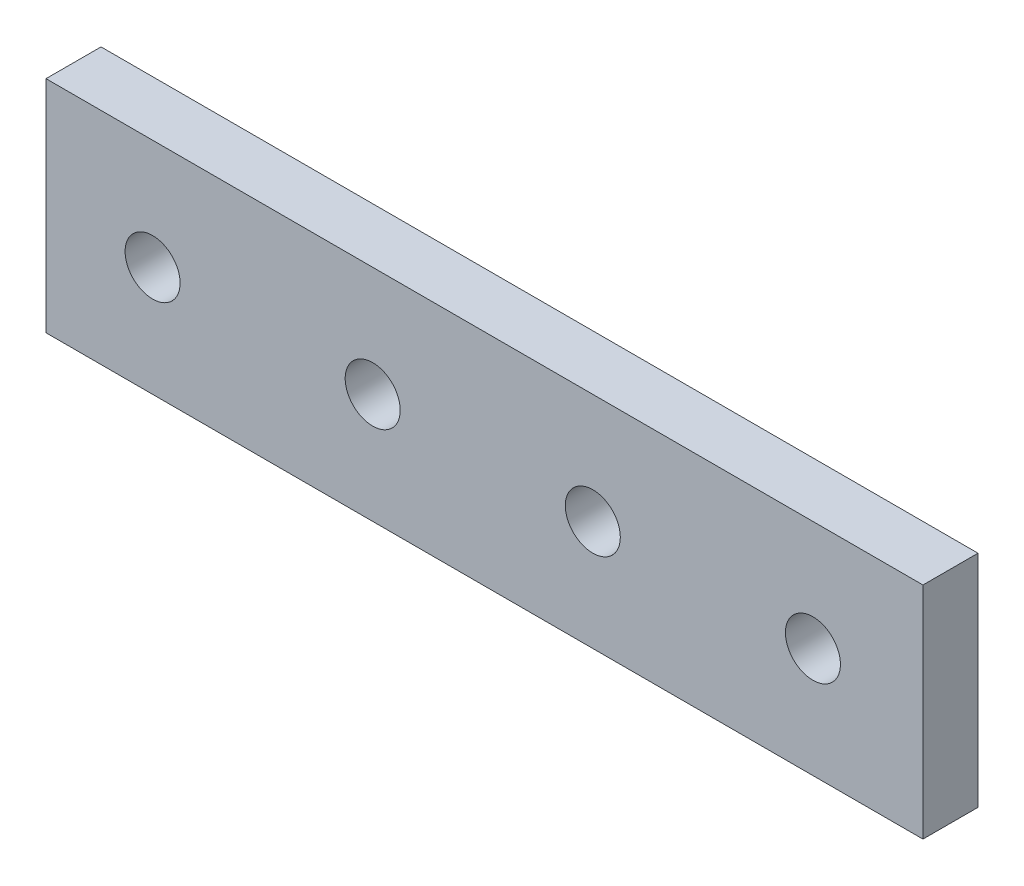
ISO-10303-21;
HEADER;
FILE_DESCRIPTION(('STEP AP214'),'2;1');
FILE_NAME('part.step','',(''),(''),'','','');
FILE_SCHEMA(('AUTOMOTIVE_DESIGN { 1 0 10303 214 1 1 1 1 }'));
ENDSEC;
DATA;
#1=APPLICATION_CONTEXT('core data for automotive mechanical design processes');
#2=APPLICATION_PROTOCOL_DEFINITION('international standard','automotive_design',2000,#1);
#3=PRODUCT_CONTEXT('',#1,'mechanical');
#4=PRODUCT('Part','Part','',(#3));
#5=PRODUCT_RELATED_PRODUCT_CATEGORY('part','',(#4));
#6=PRODUCT_DEFINITION_FORMATION('','',#4);
#7=PRODUCT_DEFINITION_CONTEXT('part definition',#1,'design');
#8=PRODUCT_DEFINITION('design','',#6,#7);
#9=PRODUCT_DEFINITION_SHAPE('','',#8);
#10=(LENGTH_UNIT() NAMED_UNIT(*) SI_UNIT(.MILLI.,.METRE.));
#11=(NAMED_UNIT(*) PLANE_ANGLE_UNIT() SI_UNIT($,.RADIAN.));
#12=(NAMED_UNIT(*) SI_UNIT($,.STERADIAN.) SOLID_ANGLE_UNIT());
#13=UNCERTAINTY_MEASURE_WITH_UNIT(LENGTH_MEASURE(1.E-05),#10,'distance_accuracy_value','');
#14=(GEOMETRIC_REPRESENTATION_CONTEXT(3) GLOBAL_UNCERTAINTY_ASSIGNED_CONTEXT((#13)) GLOBAL_UNIT_ASSIGNED_CONTEXT((#10,
#11,#12)) REPRESENTATION_CONTEXT('',''));
#15=CARTESIAN_POINT('',(0.,0.,0.));
#16=DIRECTION('',(0.,0.,1.));
#17=DIRECTION('',(1.,0.,0.));
#18=AXIS2_PLACEMENT_3D('',#15,#16,#17);
#19=CARTESIAN_POINT('',(50.6,-12.7,6.35));
#20=DIRECTION('',(-1.,0.,0.));
#21=DIRECTION('',(0.,0.,1.));
#22=AXIS2_PLACEMENT_3D('',#19,#20,#21);
#23=PLANE('',#22);
#24=DIRECTION('',(0.,1.,0.));
#25=VECTOR('',#24,1.);
#26=CARTESIAN_POINT('',(50.6,-12.7,0.));
#27=LINE('',#26,#25);
#28=CARTESIAN_POINT('',(50.6,-12.7,0.));
#29=VERTEX_POINT('',#28);
#30=CARTESIAN_POINT('',(50.6,12.7,0.));
#31=VERTEX_POINT('',#30);
#32=EDGE_CURVE('E107',#29,#31,#27,.T.);
#33=ORIENTED_EDGE('',*,*,#32,.T.);
#34=DIRECTION('',(0.,0.,-1.));
#35=VECTOR('',#34,1.);
#36=CARTESIAN_POINT('',(50.6,12.7,6.35));
#37=LINE('',#36,#35);
#38=CARTESIAN_POINT('',(50.6,12.7,6.35));
#39=VERTEX_POINT('',#38);
#40=EDGE_CURVE('E11',#39,#31,#37,.T.);
#41=ORIENTED_EDGE('',*,*,#40,.F.);
#42=DIRECTION('',(0.,1.,0.));
#43=VECTOR('',#42,1.);
#44=CARTESIAN_POINT('',(50.6,-12.7,6.35));
#45=LINE('',#44,#43);
#46=CARTESIAN_POINT('',(50.6,-12.7,6.35));
#47=VERTEX_POINT('',#46);
#48=EDGE_CURVE('E91',#47,#39,#45,.T.);
#49=ORIENTED_EDGE('',*,*,#48,.F.);
#50=DIRECTION('',(0.,0.,-1.));
#51=VECTOR('',#50,1.);
#52=CARTESIAN_POINT('',(50.6,-12.7,6.35));
#53=LINE('',#52,#51);
#54=EDGE_CURVE('E103',#47,#29,#53,.T.);
#55=ORIENTED_EDGE('',*,*,#54,.T.);
#56=EDGE_LOOP('',(#33,#41,#49,#55));
#57=FACE_BOUND('',#56,.T.);
#58=ADVANCED_FACE('F39',(#57),#23,.F.);
#59=CARTESIAN_POINT('',(-50.6,12.7,6.35));
#60=DIRECTION('',(0.,-1.,0.));
#61=DIRECTION('',(0.,0.,-1.));
#62=AXIS2_PLACEMENT_3D('',#59,#60,#61);
#63=PLANE('',#62);
#64=DIRECTION('',(-1.,0.,0.));
#65=VECTOR('',#64,1.);
#66=CARTESIAN_POINT('',(-50.6,12.7,0.));
#67=LINE('',#66,#65);
#68=CARTESIAN_POINT('',(-50.6,12.7,0.));
#69=VERTEX_POINT('',#68);
#70=EDGE_CURVE('E96',#31,#69,#67,.T.);
#71=ORIENTED_EDGE('',*,*,#70,.T.);
#72=DIRECTION('',(0.,0.,-1.));
#73=VECTOR('',#72,1.);
#74=CARTESIAN_POINT('',(-50.6,12.7,6.35));
#75=LINE('',#74,#73);
#76=CARTESIAN_POINT('',(-50.6,12.7,6.35));
#77=VERTEX_POINT('',#76);
#78=EDGE_CURVE('E48',#77,#69,#75,.T.);
#79=ORIENTED_EDGE('',*,*,#78,.F.);
#80=DIRECTION('',(-1.,0.,0.));
#81=VECTOR('',#80,1.);
#82=CARTESIAN_POINT('',(-50.6,12.7,6.35));
#83=LINE('',#82,#81);
#84=EDGE_CURVE('E86',#39,#77,#83,.T.);
#85=ORIENTED_EDGE('',*,*,#84,.F.);
#86=ORIENTED_EDGE('',*,*,#40,.T.);
#87=EDGE_LOOP('',(#71,#79,#85,#86));
#88=FACE_BOUND('',#87,.T.);
#89=ADVANCED_FACE('F95',(#88),#63,.F.);
#90=CARTESIAN_POINT('',(-50.6,-12.7,6.35));
#91=DIRECTION('',(1.,0.,0.));
#92=DIRECTION('',(0.,0.,-1.));
#93=AXIS2_PLACEMENT_3D('',#90,#91,#92);
#94=PLANE('',#93);
#95=DIRECTION('',(0.,-1.,0.));
#96=VECTOR('',#95,1.);
#97=CARTESIAN_POINT('',(-50.6,-12.7,0.));
#98=LINE('',#97,#96);
#99=CARTESIAN_POINT('',(-50.6,-12.7,0.));
#100=VERTEX_POINT('',#99);
#101=EDGE_CURVE('E73',#69,#100,#98,.T.);
#102=ORIENTED_EDGE('',*,*,#101,.T.);
#103=DIRECTION('',(0.,0.,-1.));
#104=VECTOR('',#103,1.);
#105=CARTESIAN_POINT('',(-50.6,-12.7,6.35));
#106=LINE('',#105,#104);
#107=CARTESIAN_POINT('',(-50.6,-12.7,6.35));
#108=VERTEX_POINT('',#107);
#109=EDGE_CURVE('E98',#108,#100,#106,.T.);
#110=ORIENTED_EDGE('',*,*,#109,.F.);
#111=DIRECTION('',(0.,-1.,0.));
#112=VECTOR('',#111,1.);
#113=CARTESIAN_POINT('',(-50.6,-12.7,6.35));
#114=LINE('',#113,#112);
#115=EDGE_CURVE('E89',#77,#108,#114,.T.);
#116=ORIENTED_EDGE('',*,*,#115,.F.);
#117=ORIENTED_EDGE('',*,*,#78,.T.);
#118=EDGE_LOOP('',(#102,#110,#116,#117));
#119=FACE_BOUND('',#118,.T.);
#120=ADVANCED_FACE('F99',(#119),#94,.F.);
#121=CARTESIAN_POINT('',(-50.6,-12.7,6.35));
#122=DIRECTION('',(0.,1.,0.));
#123=DIRECTION('',(0.,0.,1.));
#124=AXIS2_PLACEMENT_3D('',#121,#122,#123);
#125=PLANE('',#124);
#126=DIRECTION('',(1.,0.,0.));
#127=VECTOR('',#126,1.);
#128=CARTESIAN_POINT('',(-50.6,-12.7,0.));
#129=LINE('',#128,#127);
#130=EDGE_CURVE('E79',#100,#29,#129,.T.);
#131=ORIENTED_EDGE('',*,*,#130,.T.);
#132=ORIENTED_EDGE('',*,*,#54,.F.);
#133=DIRECTION('',(1.,0.,0.));
#134=VECTOR('',#133,1.);
#135=CARTESIAN_POINT('',(-50.6,-12.7,6.35));
#136=LINE('',#135,#134);
#137=EDGE_CURVE('E56',#108,#47,#136,.T.);
#138=ORIENTED_EDGE('',*,*,#137,.F.);
#139=ORIENTED_EDGE('',*,*,#109,.T.);
#140=EDGE_LOOP('',(#131,#132,#138,#139));
#141=FACE_BOUND('',#140,.T.);
#142=ADVANCED_FACE('F121',(#141),#125,.F.);
#143=CARTESIAN_POINT('',(0.,0.,6.35));
#144=DIRECTION('',(0.,0.,-1.));
#145=DIRECTION('',(-1.,0.,0.));
#146=AXIS2_PLACEMENT_3D('',#143,#144,#145);
#147=PLANE('',#146);
#148=CARTESIAN_POINT('',(-38.3,0.,6.35));
#149=DIRECTION('',(0.,0.,1.));
#150=DIRECTION('',(1.,0.,0.));
#151=AXIS2_PLACEMENT_3D('',#148,#149,#150);
#152=CIRCLE('',#151,3.17500000000001);
#153=CARTESIAN_POINT('',(-35.125,0.,6.35));
#154=VERTEX_POINT('',#153);
#155=EDGE_CURVE('E152',#154,#154,#152,.T.);
#156=ORIENTED_EDGE('',*,*,#155,.F.);
#157=EDGE_LOOP('',(#156));
#158=FACE_BOUND('',#157,.T.);
#159=CARTESIAN_POINT('',(12.5,0.,6.35));
#160=DIRECTION('',(0.,0.,1.));
#161=DIRECTION('',(1.,0.,0.));
#162=AXIS2_PLACEMENT_3D('',#159,#160,#161);
#163=CIRCLE('',#162,3.175);
#164=CARTESIAN_POINT('',(15.675,0.,6.35));
#165=VERTEX_POINT('',#164);
#166=EDGE_CURVE('E144',#165,#165,#163,.T.);
#167=ORIENTED_EDGE('',*,*,#166,.F.);
#168=EDGE_LOOP('',(#167));
#169=FACE_BOUND('',#168,.T.);
#170=CARTESIAN_POINT('',(37.9,0.,6.35));
#171=DIRECTION('',(0.,0.,1.));
#172=DIRECTION('',(1.,0.,0.));
#173=AXIS2_PLACEMENT_3D('',#170,#171,#172);
#174=CIRCLE('',#173,3.175);
#175=CARTESIAN_POINT('',(41.075,0.,6.35));
#176=VERTEX_POINT('',#175);
#177=EDGE_CURVE('E136',#176,#176,#174,.T.);
#178=ORIENTED_EDGE('',*,*,#177,.F.);
#179=EDGE_LOOP('',(#178));
#180=FACE_BOUND('',#179,.T.);
#181=CARTESIAN_POINT('',(-12.9,0.,6.35));
#182=DIRECTION('',(0.,0.,1.));
#183=DIRECTION('',(1.,0.,0.));
#184=AXIS2_PLACEMENT_3D('',#181,#182,#183);
#185=CIRCLE('',#184,3.175);
#186=CARTESIAN_POINT('',(-9.72499999999999,0.,6.35));
#187=VERTEX_POINT('',#186);
#188=EDGE_CURVE('E128',#187,#187,#185,.T.);
#189=ORIENTED_EDGE('',*,*,#188,.F.);
#190=EDGE_LOOP('',(#189));
#191=FACE_BOUND('',#190,.T.);
#192=ORIENTED_EDGE('',*,*,#48,.T.);
#193=ORIENTED_EDGE('',*,*,#84,.T.);
#194=ORIENTED_EDGE('',*,*,#115,.T.);
#195=ORIENTED_EDGE('',*,*,#137,.T.);
#196=EDGE_LOOP('',(#192,#193,#194,#195));
#197=FACE_BOUND('',#196,.T.);
#198=ADVANCED_FACE('F87',(#158,#169,#180,#191,#197),#147,.F.);
#199=CARTESIAN_POINT('',(0.,0.,0.));
#200=DIRECTION('',(0.,0.,-1.));
#201=DIRECTION('',(-1.,0.,0.));
#202=AXIS2_PLACEMENT_3D('',#199,#200,#201);
#203=PLANE('',#202);
#204=CARTESIAN_POINT('',(-38.3,0.,0.));
#205=DIRECTION('',(0.,0.,1.));
#206=DIRECTION('',(1.,0.,0.));
#207=AXIS2_PLACEMENT_3D('',#204,#205,#206);
#208=CIRCLE('',#207,3.17500000000001);
#209=CARTESIAN_POINT('',(-35.125,0.,0.));
#210=VERTEX_POINT('',#209);
#211=EDGE_CURVE('E111',#210,#210,#208,.T.);
#212=ORIENTED_EDGE('',*,*,#211,.T.);
#213=EDGE_LOOP('',(#212));
#214=FACE_BOUND('',#213,.T.);
#215=CARTESIAN_POINT('',(12.5,0.,0.));
#216=DIRECTION('',(0.,0.,1.));
#217=DIRECTION('',(1.,0.,0.));
#218=AXIS2_PLACEMENT_3D('',#215,#216,#217);
#219=CIRCLE('',#218,3.175);
#220=CARTESIAN_POINT('',(15.675,0.,0.));
#221=VERTEX_POINT('',#220);
#222=EDGE_CURVE('E148',#221,#221,#219,.T.);
#223=ORIENTED_EDGE('',*,*,#222,.T.);
#224=EDGE_LOOP('',(#223));
#225=FACE_BOUND('',#224,.T.);
#226=CARTESIAN_POINT('',(37.9,0.,0.));
#227=DIRECTION('',(0.,0.,1.));
#228=DIRECTION('',(1.,0.,0.));
#229=AXIS2_PLACEMENT_3D('',#226,#227,#228);
#230=CIRCLE('',#229,3.175);
#231=CARTESIAN_POINT('',(41.075,0.,0.));
#232=VERTEX_POINT('',#231);
#233=EDGE_CURVE('E140',#232,#232,#230,.T.);
#234=ORIENTED_EDGE('',*,*,#233,.T.);
#235=EDGE_LOOP('',(#234));
#236=FACE_BOUND('',#235,.T.);
#237=CARTESIAN_POINT('',(-12.9,0.,0.));
#238=DIRECTION('',(0.,0.,1.));
#239=DIRECTION('',(1.,0.,0.));
#240=AXIS2_PLACEMENT_3D('',#237,#238,#239);
#241=CIRCLE('',#240,3.175);
#242=CARTESIAN_POINT('',(-9.72499999999999,0.,0.));
#243=VERTEX_POINT('',#242);
#244=EDGE_CURVE('E132',#243,#243,#241,.T.);
#245=ORIENTED_EDGE('',*,*,#244,.T.);
#246=EDGE_LOOP('',(#245));
#247=FACE_BOUND('',#246,.T.);
#248=ORIENTED_EDGE('',*,*,#32,.F.);
#249=ORIENTED_EDGE('',*,*,#130,.F.);
#250=ORIENTED_EDGE('',*,*,#101,.F.);
#251=ORIENTED_EDGE('',*,*,#70,.F.);
#252=EDGE_LOOP('',(#248,#249,#250,#251));
#253=FACE_BOUND('',#252,.T.);
#254=ADVANCED_FACE('F124',(#214,#225,#236,#247,#253),#203,.T.);
#255=CARTESIAN_POINT('',(-12.9,0.,0.));
#256=DIRECTION('',(0.,0.,1.));
#257=DIRECTION('',(1.,0.,0.));
#258=AXIS2_PLACEMENT_3D('',#255,#256,#257);
#259=CYLINDRICAL_SURFACE('',#258,3.175);
#260=ORIENTED_EDGE('',*,*,#244,.F.);
#261=EDGE_LOOP('',(#260));
#262=FACE_BOUND('',#261,.T.);
#263=ORIENTED_EDGE('',*,*,#188,.T.);
#264=EDGE_LOOP('',(#263));
#265=FACE_BOUND('',#264,.T.);
#266=ADVANCED_FACE('F178',(#262,#265),#259,.F.);
#267=CARTESIAN_POINT('',(37.9,0.,0.));
#268=DIRECTION('',(0.,0.,1.));
#269=DIRECTION('',(1.,0.,0.));
#270=AXIS2_PLACEMENT_3D('',#267,#268,#269);
#271=CYLINDRICAL_SURFACE('',#270,3.175);
#272=ORIENTED_EDGE('',*,*,#233,.F.);
#273=EDGE_LOOP('',(#272));
#274=FACE_BOUND('',#273,.T.);
#275=ORIENTED_EDGE('',*,*,#177,.T.);
#276=EDGE_LOOP('',(#275));
#277=FACE_BOUND('',#276,.T.);
#278=ADVANCED_FACE('F180',(#274,#277),#271,.F.);
#279=CARTESIAN_POINT('',(12.5,0.,0.));
#280=DIRECTION('',(0.,0.,1.));
#281=DIRECTION('',(1.,0.,0.));
#282=AXIS2_PLACEMENT_3D('',#279,#280,#281);
#283=CYLINDRICAL_SURFACE('',#282,3.175);
#284=ORIENTED_EDGE('',*,*,#222,.F.);
#285=EDGE_LOOP('',(#284));
#286=FACE_BOUND('',#285,.T.);
#287=ORIENTED_EDGE('',*,*,#166,.T.);
#288=EDGE_LOOP('',(#287));
#289=FACE_BOUND('',#288,.T.);
#290=ADVANCED_FACE('F165',(#286,#289),#283,.F.);
#291=CARTESIAN_POINT('',(-38.3,0.,0.));
#292=DIRECTION('',(0.,0.,1.));
#293=DIRECTION('',(1.,0.,0.));
#294=AXIS2_PLACEMENT_3D('',#291,#292,#293);
#295=CYLINDRICAL_SURFACE('',#294,3.17500000000001);
#296=ORIENTED_EDGE('',*,*,#211,.F.);
#297=EDGE_LOOP('',(#296));
#298=FACE_BOUND('',#297,.T.);
#299=ORIENTED_EDGE('',*,*,#155,.T.);
#300=EDGE_LOOP('',(#299));
#301=FACE_BOUND('',#300,.T.);
#302=ADVANCED_FACE('F162',(#298,#301),#295,.F.);
#303=CLOSED_SHELL('',(#58,#89,#120,#142,#198,#254,#266,#278,#290,#302));
#304=MANIFOLD_SOLID_BREP('B2',#303);
#305=ADVANCED_BREP_SHAPE_REPRESENTATION('',(#18,#304),#14);
#306=SHAPE_DEFINITION_REPRESENTATION(#9,#305);
ENDSEC;
END-ISO-10303-21;
